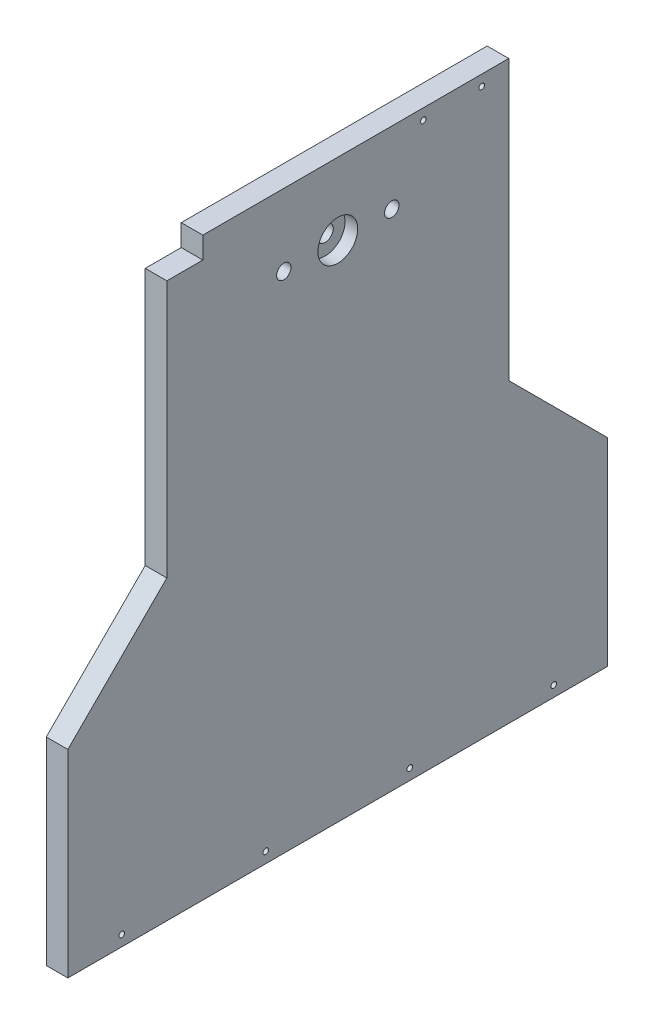
ISO-10303-21;
HEADER;
FILE_DESCRIPTION(('STEP AP214'),'2;1');
FILE_NAME('part.step','',(''),(''),'','','');
FILE_SCHEMA(('AUTOMOTIVE_DESIGN { 1 0 10303 214 1 1 1 1 }'));
ENDSEC;
DATA;
#1=APPLICATION_CONTEXT('core data for automotive mechanical design processes');
#2=APPLICATION_PROTOCOL_DEFINITION('international standard','automotive_design',2000,#1);
#3=PRODUCT_CONTEXT('',#1,'mechanical');
#4=PRODUCT('Part','Part','',(#3));
#5=PRODUCT_RELATED_PRODUCT_CATEGORY('part','',(#4));
#6=PRODUCT_DEFINITION_FORMATION('','',#4);
#7=PRODUCT_DEFINITION_CONTEXT('part definition',#1,'design');
#8=PRODUCT_DEFINITION('design','',#6,#7);
#9=PRODUCT_DEFINITION_SHAPE('','',#8);
#10=(LENGTH_UNIT() NAMED_UNIT(*) SI_UNIT(.MILLI.,.METRE.));
#11=(NAMED_UNIT(*) PLANE_ANGLE_UNIT() SI_UNIT($,.RADIAN.));
#12=(NAMED_UNIT(*) SI_UNIT($,.STERADIAN.) SOLID_ANGLE_UNIT());
#13=UNCERTAINTY_MEASURE_WITH_UNIT(LENGTH_MEASURE(1.E-05),#10,'distance_accuracy_value','');
#14=(GEOMETRIC_REPRESENTATION_CONTEXT(3) GLOBAL_UNCERTAINTY_ASSIGNED_CONTEXT((#13)) GLOBAL_UNIT_ASSIGNED_CONTEXT((#10,
#11,#12)) REPRESENTATION_CONTEXT('',''));
#15=CARTESIAN_POINT('',(0.,0.,0.));
#16=DIRECTION('',(0.,0.,1.));
#17=DIRECTION('',(1.,0.,0.));
#18=AXIS2_PLACEMENT_3D('',#15,#16,#17);
#19=CARTESIAN_POINT('',(12.,280.,0.));
#20=DIRECTION('',(-1.,0.,0.));
#21=DIRECTION('',(0.,0.,1.));
#22=AXIS2_PLACEMENT_3D('',#19,#20,#21);
#23=CYLINDRICAL_SURFACE('',#22,4.5);
#24=CARTESIAN_POINT('',(0.,280.,0.));
#25=DIRECTION('',(-1.,0.,0.));
#26=DIRECTION('',(0.,0.,1.));
#27=AXIS2_PLACEMENT_3D('',#24,#25,#26);
#28=CIRCLE('',#27,4.5);
#29=CARTESIAN_POINT('',(0.,280.,4.5));
#30=VERTEX_POINT('',#29);
#31=EDGE_CURVE('E213',#30,#30,#28,.T.);
#32=ORIENTED_EDGE('',*,*,#31,.T.);
#33=EDGE_LOOP('',(#32));
#34=FACE_BOUND('',#33,.T.);
#35=CARTESIAN_POINT('',(5.,280.,0.));
#36=DIRECTION('',(1.,0.,0.));
#37=DIRECTION('',(0.,0.,-1.));
#38=AXIS2_PLACEMENT_3D('',#35,#36,#37);
#39=CIRCLE('',#38,4.5);
#40=CARTESIAN_POINT('',(5.,280.,-4.5));
#41=VERTEX_POINT('',#40);
#42=EDGE_CURVE('E37',#41,#41,#39,.F.);
#43=ORIENTED_EDGE('',*,*,#42,.F.);
#44=EDGE_LOOP('',(#43));
#45=FACE_BOUND('',#44,.T.);
#46=ADVANCED_FACE('F33',(#34,#45),#23,.F.);
#47=CARTESIAN_POINT('',(12.,110.,-150.));
#48=DIRECTION('',(0.,0.,1.));
#49=DIRECTION('',(1.,0.,0.));
#50=AXIS2_PLACEMENT_3D('',#47,#48,#49);
#51=PLANE('',#50);
#52=DIRECTION('',(0.,1.,0.));
#53=VECTOR('',#52,1.);
#54=CARTESIAN_POINT('',(0.,110.,-150.));
#55=LINE('',#54,#53);
#56=CARTESIAN_POINT('',(0.,0.,-150.));
#57=VERTEX_POINT('',#56);
#58=CARTESIAN_POINT('',(0.,110.,-150.));
#59=VERTEX_POINT('',#58);
#60=EDGE_CURVE('E140',#57,#59,#55,.T.);
#61=ORIENTED_EDGE('',*,*,#60,.T.);
#62=DIRECTION('',(-1.,0.,0.));
#63=VECTOR('',#62,1.);
#64=CARTESIAN_POINT('',(12.,110.,-150.));
#65=LINE('',#64,#63);
#66=CARTESIAN_POINT('',(12.,110.,-150.));
#67=VERTEX_POINT('',#66);
#68=EDGE_CURVE('E11',#67,#59,#65,.T.);
#69=ORIENTED_EDGE('',*,*,#68,.F.);
#70=DIRECTION('',(0.,1.,0.));
#71=VECTOR('',#70,1.);
#72=CARTESIAN_POINT('',(12.,110.,-150.));
#73=LINE('',#72,#71);
#74=CARTESIAN_POINT('',(12.,0.,-150.));
#75=VERTEX_POINT('',#74);
#76=EDGE_CURVE('E157',#75,#67,#73,.T.);
#77=ORIENTED_EDGE('',*,*,#76,.F.);
#78=DIRECTION('',(-1.,0.,0.));
#79=VECTOR('',#78,1.);
#80=CARTESIAN_POINT('',(12.,0.,-150.));
#81=LINE('',#80,#79);
#82=EDGE_CURVE('E136',#75,#57,#81,.T.);
#83=ORIENTED_EDGE('',*,*,#82,.T.);
#84=EDGE_LOOP('',(#61,#69,#77,#83));
#85=FACE_BOUND('',#84,.T.);
#86=ADVANCED_FACE('F35',(#85),#51,.F.);
#87=CARTESIAN_POINT('',(12.,165.,-94.9999999999998));
#88=DIRECTION('',(0.,-0.707106781186548,0.707106781186546));
#89=DIRECTION('',(0.,-0.707106781186546,-0.707106781186549));
#90=AXIS2_PLACEMENT_3D('',#87,#88,#89);
#91=PLANE('',#90);
#92=DIRECTION('',(0.,0.707106781186546,0.707106781186549));
#93=VECTOR('',#92,1.);
#94=CARTESIAN_POINT('',(0.,165.,-94.9999999999998));
#95=LINE('',#94,#93);
#96=CARTESIAN_POINT('',(0.,165.,-94.9999999999998));
#97=VERTEX_POINT('',#96);
#98=EDGE_CURVE('E143',#59,#97,#95,.T.);
#99=ORIENTED_EDGE('',*,*,#98,.T.);
#100=DIRECTION('',(-1.,0.,0.));
#101=VECTOR('',#100,1.);
#102=CARTESIAN_POINT('',(12.,165.,-94.9999999999998));
#103=LINE('',#102,#101);
#104=CARTESIAN_POINT('',(12.,165.,-94.9999999999998));
#105=VERTEX_POINT('',#104);
#106=EDGE_CURVE('E42',#105,#97,#103,.T.);
#107=ORIENTED_EDGE('',*,*,#106,.F.);
#108=DIRECTION('',(0.,0.707106781186546,0.707106781186549));
#109=VECTOR('',#108,1.);
#110=CARTESIAN_POINT('',(12.,165.,-94.9999999999998));
#111=LINE('',#110,#109);
#112=EDGE_CURVE('E96',#67,#105,#111,.T.);
#113=ORIENTED_EDGE('',*,*,#112,.F.);
#114=ORIENTED_EDGE('',*,*,#68,.T.);
#115=EDGE_LOOP('',(#99,#107,#113,#114));
#116=FACE_BOUND('',#115,.T.);
#117=ADVANCED_FACE('F234',(#116),#91,.F.);
#118=CARTESIAN_POINT('',(12.,320.,-94.9999999999998));
#119=DIRECTION('',(0.,0.,1.));
#120=DIRECTION('',(0.,-1.,0.));
#121=AXIS2_PLACEMENT_3D('',#118,#119,#120);
#122=PLANE('',#121);
#123=DIRECTION('',(0.,1.,0.));
#124=VECTOR('',#123,1.);
#125=CARTESIAN_POINT('',(0.,320.,-94.9999999999998));
#126=LINE('',#125,#124);
#127=CARTESIAN_POINT('',(0.,320.,-94.9999999999998));
#128=VERTEX_POINT('',#127);
#129=EDGE_CURVE('E146',#97,#128,#126,.T.);
#130=ORIENTED_EDGE('',*,*,#129,.T.);
#131=DIRECTION('',(-1.,0.,0.));
#132=VECTOR('',#131,1.);
#133=CARTESIAN_POINT('',(12.,320.,-94.9999999999998));
#134=LINE('',#133,#132);
#135=CARTESIAN_POINT('',(12.,320.,-94.9999999999998));
#136=VERTEX_POINT('',#135);
#137=EDGE_CURVE('E161',#136,#128,#134,.T.);
#138=ORIENTED_EDGE('',*,*,#137,.F.);
#139=DIRECTION('',(0.,1.,0.));
#140=VECTOR('',#139,1.);
#141=CARTESIAN_POINT('',(12.,320.,-94.9999999999998));
#142=LINE('',#141,#140);
#143=EDGE_CURVE('E170',#105,#136,#142,.T.);
#144=ORIENTED_EDGE('',*,*,#143,.F.);
#145=ORIENTED_EDGE('',*,*,#106,.T.);
#146=EDGE_LOOP('',(#130,#138,#144,#145));
#147=FACE_BOUND('',#146,.T.);
#148=ADVANCED_FACE('F168',(#147),#122,.F.);
#149=CARTESIAN_POINT('',(12.,320.,-94.9999999999998));
#150=DIRECTION('',(0.,-1.,0.));
#151=DIRECTION('',(0.,0.,-1.));
#152=AXIS2_PLACEMENT_3D('',#149,#150,#151);
#153=PLANE('',#152);
#154=DIRECTION('',(0.,0.,1.));
#155=VECTOR('',#154,1.);
#156=CARTESIAN_POINT('',(0.,320.,-94.9999999999998));
#157=LINE('',#156,#155);
#158=CARTESIAN_POINT('',(0.,320.,74.9999999999998));
#159=VERTEX_POINT('',#158);
#160=EDGE_CURVE('E148',#128,#159,#157,.T.);
#161=ORIENTED_EDGE('',*,*,#160,.T.);
#162=DIRECTION('',(1.,0.,0.));
#163=VECTOR('',#162,1.);
#164=CARTESIAN_POINT('',(0.,320.,74.9999999999998));
#165=LINE('',#164,#163);
#166=CARTESIAN_POINT('',(12.,320.,74.9999999999998));
#167=VERTEX_POINT('',#166);
#168=EDGE_CURVE('E180',#159,#167,#165,.T.);
#169=ORIENTED_EDGE('',*,*,#168,.T.);
#170=DIRECTION('',(0.,0.,1.));
#171=VECTOR('',#170,1.);
#172=CARTESIAN_POINT('',(12.,320.,-94.9999999999998));
#173=LINE('',#172,#171);
#174=EDGE_CURVE('E230',#136,#167,#173,.T.);
#175=ORIENTED_EDGE('',*,*,#174,.F.);
#176=ORIENTED_EDGE('',*,*,#137,.T.);
#177=EDGE_LOOP('',(#161,#169,#175,#176));
#178=FACE_BOUND('',#177,.T.);
#179=ADVANCED_FACE('F178',(#178),#153,.F.);
#180=CARTESIAN_POINT('',(12.,320.,94.9999999999998));
#181=DIRECTION('',(0.,0.,-1.));
#182=DIRECTION('',(0.,1.,0.));
#183=AXIS2_PLACEMENT_3D('',#180,#181,#182);
#184=PLANE('',#183);
#185=DIRECTION('',(0.,-1.,0.));
#186=VECTOR('',#185,1.);
#187=CARTESIAN_POINT('',(12.,320.,94.9999999999998));
#188=LINE('',#187,#186);
#189=CARTESIAN_POINT('',(12.,308.,94.9999999999998));
#190=VERTEX_POINT('',#189);
#191=CARTESIAN_POINT('',(12.,165.,94.9999999999998));
#192=VERTEX_POINT('',#191);
#193=EDGE_CURVE('E119',#190,#192,#188,.T.);
#194=ORIENTED_EDGE('',*,*,#193,.F.);
#195=DIRECTION('',(1.,0.,0.));
#196=VECTOR('',#195,1.);
#197=CARTESIAN_POINT('',(0.,308.,94.9999999999998));
#198=LINE('',#197,#196);
#199=CARTESIAN_POINT('',(0.,308.,94.9999999999998));
#200=VERTEX_POINT('',#199);
#201=EDGE_CURVE('E206',#200,#190,#198,.T.);
#202=ORIENTED_EDGE('',*,*,#201,.F.);
#203=DIRECTION('',(0.,-1.,0.));
#204=VECTOR('',#203,1.);
#205=CARTESIAN_POINT('',(0.,320.,94.9999999999998));
#206=LINE('',#205,#204);
#207=CARTESIAN_POINT('',(0.,165.,94.9999999999998));
#208=VERTEX_POINT('',#207);
#209=EDGE_CURVE('E151',#200,#208,#206,.T.);
#210=ORIENTED_EDGE('',*,*,#209,.T.);
#211=DIRECTION('',(-1.,0.,0.));
#212=VECTOR('',#211,1.);
#213=CARTESIAN_POINT('',(12.,165.,94.9999999999998));
#214=LINE('',#213,#212);
#215=EDGE_CURVE('E131',#192,#208,#214,.T.);
#216=ORIENTED_EDGE('',*,*,#215,.F.);
#217=EDGE_LOOP('',(#194,#202,#210,#216));
#218=FACE_BOUND('',#217,.T.);
#219=ADVANCED_FACE('F273',(#218),#184,.F.);
#220=CARTESIAN_POINT('',(12.,165.,94.9999999999998));
#221=DIRECTION('',(0.,-0.707106781186548,-0.707106781186546));
#222=DIRECTION('',(0.,0.707106781186546,-0.707106781186549));
#223=AXIS2_PLACEMENT_3D('',#220,#221,#222);
#224=PLANE('',#223);
#225=DIRECTION('',(0.,-0.707106781186546,0.707106781186549));
#226=VECTOR('',#225,1.);
#227=CARTESIAN_POINT('',(0.,165.,94.9999999999998));
#228=LINE('',#227,#226);
#229=CARTESIAN_POINT('',(0.,110.,150.));
#230=VERTEX_POINT('',#229);
#231=EDGE_CURVE('E128',#208,#230,#228,.T.);
#232=ORIENTED_EDGE('',*,*,#231,.T.);
#233=DIRECTION('',(-1.,0.,0.));
#234=VECTOR('',#233,1.);
#235=CARTESIAN_POINT('',(12.,110.,150.));
#236=LINE('',#235,#234);
#237=CARTESIAN_POINT('',(12.,110.,150.));
#238=VERTEX_POINT('',#237);
#239=EDGE_CURVE('E125',#238,#230,#236,.T.);
#240=ORIENTED_EDGE('',*,*,#239,.F.);
#241=DIRECTION('',(0.,-0.707106781186546,0.707106781186549));
#242=VECTOR('',#241,1.);
#243=CARTESIAN_POINT('',(12.,165.,94.9999999999998));
#244=LINE('',#243,#242);
#245=EDGE_CURVE('E109',#192,#238,#244,.T.);
#246=ORIENTED_EDGE('',*,*,#245,.F.);
#247=ORIENTED_EDGE('',*,*,#215,.T.);
#248=EDGE_LOOP('',(#232,#240,#246,#247));
#249=FACE_BOUND('',#248,.T.);
#250=ADVANCED_FACE('F126',(#249),#224,.F.);
#251=CARTESIAN_POINT('',(12.,110.,150.));
#252=DIRECTION('',(0.,0.,-1.));
#253=DIRECTION('',(-1.,0.,0.));
#254=AXIS2_PLACEMENT_3D('',#251,#252,#253);
#255=PLANE('',#254);
#256=DIRECTION('',(0.,-1.,0.));
#257=VECTOR('',#256,1.);
#258=CARTESIAN_POINT('',(0.,110.,150.));
#259=LINE('',#258,#257);
#260=CARTESIAN_POINT('',(0.,0.,150.));
#261=VERTEX_POINT('',#260);
#262=EDGE_CURVE('E154',#230,#261,#259,.T.);
#263=ORIENTED_EDGE('',*,*,#262,.T.);
#264=DIRECTION('',(-1.,0.,0.));
#265=VECTOR('',#264,1.);
#266=CARTESIAN_POINT('',(12.,0.,150.));
#267=LINE('',#266,#265);
#268=CARTESIAN_POINT('',(12.,0.,150.));
#269=VERTEX_POINT('',#268);
#270=EDGE_CURVE('E132',#269,#261,#267,.T.);
#271=ORIENTED_EDGE('',*,*,#270,.F.);
#272=DIRECTION('',(0.,-1.,0.));
#273=VECTOR('',#272,1.);
#274=CARTESIAN_POINT('',(12.,110.,150.));
#275=LINE('',#274,#273);
#276=EDGE_CURVE('E115',#238,#269,#275,.T.);
#277=ORIENTED_EDGE('',*,*,#276,.F.);
#278=ORIENTED_EDGE('',*,*,#239,.T.);
#279=EDGE_LOOP('',(#263,#271,#277,#278));
#280=FACE_BOUND('',#279,.T.);
#281=ADVANCED_FACE('F134',(#280),#255,.F.);
#282=CARTESIAN_POINT('',(12.,0.,150.));
#283=DIRECTION('',(0.,1.,0.));
#284=DIRECTION('',(0.,0.,1.));
#285=AXIS2_PLACEMENT_3D('',#282,#283,#284);
#286=PLANE('',#285);
#287=DIRECTION('',(0.,0.,-1.));
#288=VECTOR('',#287,1.);
#289=CARTESIAN_POINT('',(0.,0.,150.));
#290=LINE('',#289,#288);
#291=EDGE_CURVE('E88',#261,#57,#290,.T.);
#292=ORIENTED_EDGE('',*,*,#291,.T.);
#293=ORIENTED_EDGE('',*,*,#82,.F.);
#294=DIRECTION('',(0.,0.,-1.));
#295=VECTOR('',#294,1.);
#296=CARTESIAN_POINT('',(12.,0.,150.));
#297=LINE('',#296,#295);
#298=EDGE_CURVE('E58',#269,#75,#297,.T.);
#299=ORIENTED_EDGE('',*,*,#298,.F.);
#300=ORIENTED_EDGE('',*,*,#270,.T.);
#301=EDGE_LOOP('',(#292,#293,#299,#300));
#302=FACE_BOUND('',#301,.T.);
#303=ADVANCED_FACE('F262',(#302),#286,.F.);
#304=CARTESIAN_POINT('',(12.,0.,0.));
#305=DIRECTION('',(1.,0.,0.));
#306=DIRECTION('',(0.,0.,-1.));
#307=AXIS2_PLACEMENT_3D('',#304,#305,#306);
#308=PLANE('',#307);
#309=CARTESIAN_POINT('',(12.,314.,-47.4999999999999));
#310=DIRECTION('',(1.,0.,0.));
#311=DIRECTION('',(0.,0.,-1.));
#312=AXIS2_PLACEMENT_3D('',#309,#310,#311);
#313=CIRCLE('',#312,1.55000000000002);
#314=CARTESIAN_POINT('',(12.,314.,-49.0499999999999));
#315=VERTEX_POINT('',#314);
#316=EDGE_CURVE('E452',#315,#315,#313,.T.);
#317=ORIENTED_EDGE('',*,*,#316,.F.);
#318=EDGE_LOOP('',(#317));
#319=FACE_BOUND('',#318,.T.);
#320=CARTESIAN_POINT('',(12.,314.,-79.9999999999999));
#321=DIRECTION('',(1.,0.,0.));
#322=DIRECTION('',(0.,0.,-1.));
#323=AXIS2_PLACEMENT_3D('',#320,#321,#322);
#324=CIRCLE('',#323,1.55);
#325=CARTESIAN_POINT('',(12.,314.,-81.5499999999999));
#326=VERTEX_POINT('',#325);
#327=EDGE_CURVE('E454',#326,#326,#324,.T.);
#328=ORIENTED_EDGE('',*,*,#327,.F.);
#329=EDGE_LOOP('',(#328));
#330=FACE_BOUND('',#329,.T.);
#331=CARTESIAN_POINT('',(12.,6.,-120.));
#332=DIRECTION('',(1.,0.,0.));
#333=DIRECTION('',(0.,0.,-1.));
#334=AXIS2_PLACEMENT_3D('',#331,#332,#333);
#335=CIRCLE('',#334,1.54999999999999);
#336=CARTESIAN_POINT('',(12.,6.,-121.55));
#337=VERTEX_POINT('',#336);
#338=EDGE_CURVE('E460',#337,#337,#335,.T.);
#339=ORIENTED_EDGE('',*,*,#338,.F.);
#340=EDGE_LOOP('',(#339));
#341=FACE_BOUND('',#340,.T.);
#342=CARTESIAN_POINT('',(12.,6.,-40.));
#343=DIRECTION('',(1.,0.,0.));
#344=DIRECTION('',(0.,0.,-1.));
#345=AXIS2_PLACEMENT_3D('',#342,#343,#344);
#346=CIRCLE('',#345,1.54999999999999);
#347=CARTESIAN_POINT('',(12.,6.,-41.55));
#348=VERTEX_POINT('',#347);
#349=EDGE_CURVE('E466',#348,#348,#346,.T.);
#350=ORIENTED_EDGE('',*,*,#349,.F.);
#351=EDGE_LOOP('',(#350));
#352=FACE_BOUND('',#351,.T.);
#353=CARTESIAN_POINT('',(12.,6.,40.));
#354=DIRECTION('',(1.,0.,0.));
#355=DIRECTION('',(0.,0.,-1.));
#356=AXIS2_PLACEMENT_3D('',#353,#354,#355);
#357=CIRCLE('',#356,1.54999999999999);
#358=CARTESIAN_POINT('',(12.,6.,38.45));
#359=VERTEX_POINT('',#358);
#360=EDGE_CURVE('E472',#359,#359,#357,.T.);
#361=ORIENTED_EDGE('',*,*,#360,.F.);
#362=EDGE_LOOP('',(#361));
#363=FACE_BOUND('',#362,.T.);
#364=CARTESIAN_POINT('',(12.,6.00000000000001,120.));
#365=DIRECTION('',(1.,0.,0.));
#366=DIRECTION('',(0.,0.,-1.));
#367=AXIS2_PLACEMENT_3D('',#364,#365,#366);
#368=CIRCLE('',#367,1.54999999999999);
#369=CARTESIAN_POINT('',(12.,6.00000000000001,118.45));
#370=VERTEX_POINT('',#369);
#371=EDGE_CURVE('E478',#370,#370,#368,.T.);
#372=ORIENTED_EDGE('',*,*,#371,.F.);
#373=EDGE_LOOP('',(#372));
#374=FACE_BOUND('',#373,.T.);
#375=DIRECTION('',(0.,1.,0.));
#376=VECTOR('',#375,1.);
#377=CARTESIAN_POINT('',(12.,320.,74.9999999999998));
#378=LINE('',#377,#376);
#379=CARTESIAN_POINT('',(12.,308.,74.9999999999998));
#380=VERTEX_POINT('',#379);
#381=EDGE_CURVE('E193',#380,#167,#378,.T.);
#382=ORIENTED_EDGE('',*,*,#381,.F.);
#383=DIRECTION('',(0.,0.,-1.));
#384=VECTOR('',#383,1.);
#385=CARTESIAN_POINT('',(12.,308.,94.9999999999998));
#386=LINE('',#385,#384);
#387=EDGE_CURVE('E196',#190,#380,#386,.T.);
#388=ORIENTED_EDGE('',*,*,#387,.F.);
#389=ORIENTED_EDGE('',*,*,#193,.T.);
#390=ORIENTED_EDGE('',*,*,#245,.T.);
#391=ORIENTED_EDGE('',*,*,#276,.T.);
#392=ORIENTED_EDGE('',*,*,#298,.T.);
#393=ORIENTED_EDGE('',*,*,#76,.T.);
#394=ORIENTED_EDGE('',*,*,#112,.T.);
#395=ORIENTED_EDGE('',*,*,#143,.T.);
#396=ORIENTED_EDGE('',*,*,#174,.T.);
#397=EDGE_LOOP('',(#382,#388,#389,#390,#391,#392,#393,#394,#395,#396));
#398=FACE_BOUND('',#397,.T.);
#399=CARTESIAN_POINT('',(12.,280.,0.));
#400=DIRECTION('',(1.,0.,0.));
#401=DIRECTION('',(0.,0.,-1.));
#402=AXIS2_PLACEMENT_3D('',#399,#400,#401);
#403=CIRCLE('',#402,11.05);
#404=CARTESIAN_POINT('',(12.,280.,-11.05));
#405=VERTEX_POINT('',#404);
#406=EDGE_CURVE('E204',#405,#405,#403,.T.);
#407=ORIENTED_EDGE('',*,*,#406,.F.);
#408=EDGE_LOOP('',(#407));
#409=FACE_BOUND('',#408,.T.);
#410=CARTESIAN_POINT('',(12.,280.,-29.9999999999998));
#411=DIRECTION('',(-1.,0.,0.));
#412=DIRECTION('',(0.,0.,1.));
#413=AXIS2_PLACEMENT_3D('',#410,#411,#412);
#414=CIRCLE('',#413,4.);
#415=CARTESIAN_POINT('',(12.,280.,-25.9999999999998));
#416=VERTEX_POINT('',#415);
#417=EDGE_CURVE('E217',#416,#416,#414,.T.);
#418=ORIENTED_EDGE('',*,*,#417,.T.);
#419=EDGE_LOOP('',(#418));
#420=FACE_BOUND('',#419,.T.);
#421=CARTESIAN_POINT('',(12.,280.,29.9999999999998));
#422=DIRECTION('',(-1.,0.,0.));
#423=DIRECTION('',(0.,0.,1.));
#424=AXIS2_PLACEMENT_3D('',#421,#422,#423);
#425=CIRCLE('',#424,4.00000000000001);
#426=CARTESIAN_POINT('',(12.,280.,33.9999999999998));
#427=VERTEX_POINT('',#426);
#428=EDGE_CURVE('E144',#427,#427,#425,.T.);
#429=ORIENTED_EDGE('',*,*,#428,.T.);
#430=EDGE_LOOP('',(#429));
#431=FACE_BOUND('',#430,.T.);
#432=ADVANCED_FACE('F112',(#319,#330,#341,#352,#363,#374,#398,#409,#420,#431),#308,.T.);
#433=CARTESIAN_POINT('',(0.,0.,0.));
#434=DIRECTION('',(1.,0.,0.));
#435=DIRECTION('',(0.,0.,-1.));
#436=AXIS2_PLACEMENT_3D('',#433,#434,#435);
#437=PLANE('',#436);
#438=CARTESIAN_POINT('',(0.,314.,-47.4999999999999));
#439=DIRECTION('',(1.,0.,0.));
#440=DIRECTION('',(0.,0.,-1.));
#441=AXIS2_PLACEMENT_3D('',#438,#439,#440);
#442=CIRCLE('',#441,1.55000000000002);
#443=CARTESIAN_POINT('',(0.,314.,-49.0499999999999));
#444=VERTEX_POINT('',#443);
#445=EDGE_CURVE('E449',#444,#444,#442,.T.);
#446=ORIENTED_EDGE('',*,*,#445,.T.);
#447=EDGE_LOOP('',(#446));
#448=FACE_BOUND('',#447,.T.);
#449=CARTESIAN_POINT('',(0.,314.,-79.9999999999999));
#450=DIRECTION('',(1.,0.,0.));
#451=DIRECTION('',(0.,0.,-1.));
#452=AXIS2_PLACEMENT_3D('',#449,#450,#451);
#453=CIRCLE('',#452,1.55);
#454=CARTESIAN_POINT('',(0.,314.,-81.5499999999999));
#455=VERTEX_POINT('',#454);
#456=EDGE_CURVE('E457',#455,#455,#453,.T.);
#457=ORIENTED_EDGE('',*,*,#456,.T.);
#458=EDGE_LOOP('',(#457));
#459=FACE_BOUND('',#458,.T.);
#460=CARTESIAN_POINT('',(0.,6.,-120.));
#461=DIRECTION('',(1.,0.,0.));
#462=DIRECTION('',(0.,0.,-1.));
#463=AXIS2_PLACEMENT_3D('',#460,#461,#462);
#464=CIRCLE('',#463,1.54999999999999);
#465=CARTESIAN_POINT('',(0.,6.,-121.55));
#466=VERTEX_POINT('',#465);
#467=EDGE_CURVE('E463',#466,#466,#464,.T.);
#468=ORIENTED_EDGE('',*,*,#467,.T.);
#469=EDGE_LOOP('',(#468));
#470=FACE_BOUND('',#469,.T.);
#471=CARTESIAN_POINT('',(0.,6.,-40.));
#472=DIRECTION('',(1.,0.,0.));
#473=DIRECTION('',(0.,0.,-1.));
#474=AXIS2_PLACEMENT_3D('',#471,#472,#473);
#475=CIRCLE('',#474,1.54999999999999);
#476=CARTESIAN_POINT('',(0.,6.,-41.55));
#477=VERTEX_POINT('',#476);
#478=EDGE_CURVE('E469',#477,#477,#475,.T.);
#479=ORIENTED_EDGE('',*,*,#478,.T.);
#480=EDGE_LOOP('',(#479));
#481=FACE_BOUND('',#480,.T.);
#482=CARTESIAN_POINT('',(0.,6.,40.));
#483=DIRECTION('',(1.,0.,0.));
#484=DIRECTION('',(0.,0.,-1.));
#485=AXIS2_PLACEMENT_3D('',#482,#483,#484);
#486=CIRCLE('',#485,1.54999999999999);
#487=CARTESIAN_POINT('',(0.,6.,38.45));
#488=VERTEX_POINT('',#487);
#489=EDGE_CURVE('E475',#488,#488,#486,.T.);
#490=ORIENTED_EDGE('',*,*,#489,.T.);
#491=EDGE_LOOP('',(#490));
#492=FACE_BOUND('',#491,.T.);
#493=CARTESIAN_POINT('',(0.,6.00000000000001,120.));
#494=DIRECTION('',(1.,0.,0.));
#495=DIRECTION('',(0.,0.,-1.));
#496=AXIS2_PLACEMENT_3D('',#493,#494,#495);
#497=CIRCLE('',#496,1.54999999999999);
#498=CARTESIAN_POINT('',(0.,6.00000000000001,118.45));
#499=VERTEX_POINT('',#498);
#500=EDGE_CURVE('E199',#499,#499,#497,.T.);
#501=ORIENTED_EDGE('',*,*,#500,.T.);
#502=EDGE_LOOP('',(#501));
#503=FACE_BOUND('',#502,.T.);
#504=ORIENTED_EDGE('',*,*,#31,.F.);
#505=EDGE_LOOP('',(#504));
#506=FACE_BOUND('',#505,.T.);
#507=CARTESIAN_POINT('',(0.,280.,-29.9999999999998));
#508=DIRECTION('',(-1.,0.,0.));
#509=DIRECTION('',(0.,0.,1.));
#510=AXIS2_PLACEMENT_3D('',#507,#508,#509);
#511=CIRCLE('',#510,4.);
#512=CARTESIAN_POINT('',(0.,280.,-25.9999999999998));
#513=VERTEX_POINT('',#512);
#514=EDGE_CURVE('E216',#513,#513,#511,.T.);
#515=ORIENTED_EDGE('',*,*,#514,.F.);
#516=EDGE_LOOP('',(#515));
#517=FACE_BOUND('',#516,.T.);
#518=CARTESIAN_POINT('',(0.,280.,29.9999999999998));
#519=DIRECTION('',(-1.,0.,0.));
#520=DIRECTION('',(0.,0.,1.));
#521=AXIS2_PLACEMENT_3D('',#518,#519,#520);
#522=CIRCLE('',#521,4.00000000000001);
#523=CARTESIAN_POINT('',(0.,280.,33.9999999999998));
#524=VERTEX_POINT('',#523);
#525=EDGE_CURVE('E220',#524,#524,#522,.T.);
#526=ORIENTED_EDGE('',*,*,#525,.F.);
#527=EDGE_LOOP('',(#526));
#528=FACE_BOUND('',#527,.T.);
#529=DIRECTION('',(0.,0.,-1.));
#530=VECTOR('',#529,1.);
#531=CARTESIAN_POINT('',(0.,308.,94.9999999999998));
#532=LINE('',#531,#530);
#533=CARTESIAN_POINT('',(0.,308.,74.9999999999998));
#534=VERTEX_POINT('',#533);
#535=EDGE_CURVE('E195',#200,#534,#532,.T.);
#536=ORIENTED_EDGE('',*,*,#535,.T.);
#537=DIRECTION('',(0.,1.,0.));
#538=VECTOR('',#537,1.);
#539=CARTESIAN_POINT('',(0.,320.,74.9999999999998));
#540=LINE('',#539,#538);
#541=EDGE_CURVE('E49',#534,#159,#540,.T.);
#542=ORIENTED_EDGE('',*,*,#541,.T.);
#543=ORIENTED_EDGE('',*,*,#160,.F.);
#544=ORIENTED_EDGE('',*,*,#129,.F.);
#545=ORIENTED_EDGE('',*,*,#98,.F.);
#546=ORIENTED_EDGE('',*,*,#60,.F.);
#547=ORIENTED_EDGE('',*,*,#291,.F.);
#548=ORIENTED_EDGE('',*,*,#262,.F.);
#549=ORIENTED_EDGE('',*,*,#231,.F.);
#550=ORIENTED_EDGE('',*,*,#209,.F.);
#551=EDGE_LOOP('',(#536,#542,#543,#544,#545,#546,#547,#548,#549,#550));
#552=FACE_BOUND('',#551,.T.);
#553=ADVANCED_FACE('F174',(#448,#459,#470,#481,#492,#503,#506,#517,#528,#552),#437,.F.);
#554=CARTESIAN_POINT('',(12.,280.,29.9999999999998));
#555=DIRECTION('',(-1.,0.,0.));
#556=DIRECTION('',(0.,0.,1.));
#557=AXIS2_PLACEMENT_3D('',#554,#555,#556);
#558=CYLINDRICAL_SURFACE('',#557,4.00000000000001);
#559=ORIENTED_EDGE('',*,*,#428,.F.);
#560=EDGE_LOOP('',(#559));
#561=FACE_BOUND('',#560,.T.);
#562=ORIENTED_EDGE('',*,*,#525,.T.);
#563=EDGE_LOOP('',(#562));
#564=FACE_BOUND('',#563,.T.);
#565=ADVANCED_FACE('F255',(#561,#564),#558,.F.);
#566=CARTESIAN_POINT('',(12.,280.,-29.9999999999998));
#567=DIRECTION('',(-1.,0.,0.));
#568=DIRECTION('',(0.,0.,1.));
#569=AXIS2_PLACEMENT_3D('',#566,#567,#568);
#570=CYLINDRICAL_SURFACE('',#569,4.);
#571=ORIENTED_EDGE('',*,*,#417,.F.);
#572=EDGE_LOOP('',(#571));
#573=FACE_BOUND('',#572,.T.);
#574=ORIENTED_EDGE('',*,*,#514,.T.);
#575=EDGE_LOOP('',(#574));
#576=FACE_BOUND('',#575,.T.);
#577=ADVANCED_FACE('F251',(#573,#576),#570,.F.);
#578=CARTESIAN_POINT('',(5.,280.,0.));
#579=DIRECTION('',(1.,0.,0.));
#580=DIRECTION('',(0.,0.,-1.));
#581=AXIS2_PLACEMENT_3D('',#578,#579,#580);
#582=PLANE('',#581);
#583=CARTESIAN_POINT('',(5.,280.,0.));
#584=DIRECTION('',(1.,0.,0.));
#585=DIRECTION('',(0.,0.,-1.));
#586=AXIS2_PLACEMENT_3D('',#583,#584,#585);
#587=CIRCLE('',#586,11.05);
#588=CARTESIAN_POINT('',(5.,280.,-11.05));
#589=VERTEX_POINT('',#588);
#590=EDGE_CURVE('E208',#589,#589,#587,.T.);
#591=ORIENTED_EDGE('',*,*,#590,.T.);
#592=EDGE_LOOP('',(#591));
#593=FACE_BOUND('',#592,.T.);
#594=ORIENTED_EDGE('',*,*,#42,.T.);
#595=EDGE_LOOP('',(#594));
#596=FACE_BOUND('',#595,.T.);
#597=ADVANCED_FACE('F254',(#593,#596),#582,.T.);
#598=CARTESIAN_POINT('',(5.,280.,0.));
#599=DIRECTION('',(1.,0.,0.));
#600=DIRECTION('',(0.,0.,-1.));
#601=AXIS2_PLACEMENT_3D('',#598,#599,#600);
#602=CYLINDRICAL_SURFACE('',#601,11.05);
#603=ORIENTED_EDGE('',*,*,#590,.F.);
#604=EDGE_LOOP('',(#603));
#605=FACE_BOUND('',#604,.T.);
#606=ORIENTED_EDGE('',*,*,#406,.T.);
#607=EDGE_LOOP('',(#606));
#608=FACE_BOUND('',#607,.T.);
#609=ADVANCED_FACE('F249',(#605,#608),#602,.F.);
#610=CARTESIAN_POINT('',(0.,320.,74.9999999999998));
#611=DIRECTION('',(0.,0.,-1.));
#612=DIRECTION('',(-1.,0.,0.));
#613=AXIS2_PLACEMENT_3D('',#610,#611,#612);
#614=PLANE('',#613);
#615=ORIENTED_EDGE('',*,*,#381,.T.);
#616=ORIENTED_EDGE('',*,*,#168,.F.);
#617=ORIENTED_EDGE('',*,*,#541,.F.);
#618=DIRECTION('',(1.,0.,0.));
#619=VECTOR('',#618,1.);
#620=CARTESIAN_POINT('',(0.,308.,74.9999999999998));
#621=LINE('',#620,#619);
#622=EDGE_CURVE('E191',#534,#380,#621,.T.);
#623=ORIENTED_EDGE('',*,*,#622,.T.);
#624=EDGE_LOOP('',(#615,#616,#617,#623));
#625=FACE_BOUND('',#624,.T.);
#626=ADVANCED_FACE('F194',(#625),#614,.F.);
#627=CARTESIAN_POINT('',(0.,308.,94.9999999999998));
#628=DIRECTION('',(0.,-1.,0.));
#629=DIRECTION('',(0.,0.,-1.));
#630=AXIS2_PLACEMENT_3D('',#627,#628,#629);
#631=PLANE('',#630);
#632=ORIENTED_EDGE('',*,*,#387,.T.);
#633=ORIENTED_EDGE('',*,*,#622,.F.);
#634=ORIENTED_EDGE('',*,*,#535,.F.);
#635=ORIENTED_EDGE('',*,*,#201,.T.);
#636=EDGE_LOOP('',(#632,#633,#634,#635));
#637=FACE_BOUND('',#636,.T.);
#638=ADVANCED_FACE('F334',(#637),#631,.F.);
#639=CARTESIAN_POINT('',(0.,6.00000000000001,120.));
#640=DIRECTION('',(1.,0.,0.));
#641=DIRECTION('',(0.,0.,-1.));
#642=AXIS2_PLACEMENT_3D('',#639,#640,#641);
#643=CYLINDRICAL_SURFACE('',#642,1.54999999999999);
#644=ORIENTED_EDGE('',*,*,#500,.F.);
#645=EDGE_LOOP('',(#644));
#646=FACE_BOUND('',#645,.T.);
#647=ORIENTED_EDGE('',*,*,#371,.T.);
#648=EDGE_LOOP('',(#647));
#649=FACE_BOUND('',#648,.T.);
#650=ADVANCED_FACE('F340',(#646,#649),#643,.F.);
#651=CARTESIAN_POINT('',(0.,6.,40.));
#652=DIRECTION('',(1.,0.,0.));
#653=DIRECTION('',(0.,0.,-1.));
#654=AXIS2_PLACEMENT_3D('',#651,#652,#653);
#655=CYLINDRICAL_SURFACE('',#654,1.54999999999999);
#656=ORIENTED_EDGE('',*,*,#489,.F.);
#657=EDGE_LOOP('',(#656));
#658=FACE_BOUND('',#657,.T.);
#659=ORIENTED_EDGE('',*,*,#360,.T.);
#660=EDGE_LOOP('',(#659));
#661=FACE_BOUND('',#660,.T.);
#662=ADVANCED_FACE('F347',(#658,#661),#655,.F.);
#663=CARTESIAN_POINT('',(0.,6.,-40.));
#664=DIRECTION('',(1.,0.,0.));
#665=DIRECTION('',(0.,0.,-1.));
#666=AXIS2_PLACEMENT_3D('',#663,#664,#665);
#667=CYLINDRICAL_SURFACE('',#666,1.54999999999999);
#668=ORIENTED_EDGE('',*,*,#478,.F.);
#669=EDGE_LOOP('',(#668));
#670=FACE_BOUND('',#669,.T.);
#671=ORIENTED_EDGE('',*,*,#349,.T.);
#672=EDGE_LOOP('',(#671));
#673=FACE_BOUND('',#672,.T.);
#674=ADVANCED_FACE('F355',(#670,#673),#667,.F.);
#675=CARTESIAN_POINT('',(0.,6.,-120.));
#676=DIRECTION('',(1.,0.,0.));
#677=DIRECTION('',(0.,0.,-1.));
#678=AXIS2_PLACEMENT_3D('',#675,#676,#677);
#679=CYLINDRICAL_SURFACE('',#678,1.54999999999999);
#680=ORIENTED_EDGE('',*,*,#467,.F.);
#681=EDGE_LOOP('',(#680));
#682=FACE_BOUND('',#681,.T.);
#683=ORIENTED_EDGE('',*,*,#338,.T.);
#684=EDGE_LOOP('',(#683));
#685=FACE_BOUND('',#684,.T.);
#686=ADVANCED_FACE('F363',(#682,#685),#679,.F.);
#687=CARTESIAN_POINT('',(0.,314.,-79.9999999999999));
#688=DIRECTION('',(1.,0.,0.));
#689=DIRECTION('',(0.,0.,-1.));
#690=AXIS2_PLACEMENT_3D('',#687,#688,#689);
#691=CYLINDRICAL_SURFACE('',#690,1.55);
#692=ORIENTED_EDGE('',*,*,#456,.F.);
#693=EDGE_LOOP('',(#692));
#694=FACE_BOUND('',#693,.T.);
#695=ORIENTED_EDGE('',*,*,#327,.T.);
#696=EDGE_LOOP('',(#695));
#697=FACE_BOUND('',#696,.T.);
#698=ADVANCED_FACE('F371',(#694,#697),#691,.F.);
#699=CARTESIAN_POINT('',(0.,314.,-47.4999999999999));
#700=DIRECTION('',(1.,0.,0.));
#701=DIRECTION('',(0.,0.,-1.));
#702=AXIS2_PLACEMENT_3D('',#699,#700,#701);
#703=CYLINDRICAL_SURFACE('',#702,1.55000000000002);
#704=ORIENTED_EDGE('',*,*,#445,.F.);
#705=EDGE_LOOP('',(#704));
#706=FACE_BOUND('',#705,.T.);
#707=ORIENTED_EDGE('',*,*,#316,.T.);
#708=EDGE_LOOP('',(#707));
#709=FACE_BOUND('',#708,.T.);
#710=ADVANCED_FACE('F379',(#706,#709),#703,.F.);
#711=CLOSED_SHELL('',(#46,#86,#117,#148,#179,#219,#250,#281,#303,#432,#553,#565,#577,#597,#609,
#626,#638,#650,#662,#674,#686,#698,#710));
#712=MANIFOLD_SOLID_BREP('B2',#711);
#713=ADVANCED_BREP_SHAPE_REPRESENTATION('',(#18,#712),#14);
#714=SHAPE_DEFINITION_REPRESENTATION(#9,#713);
ENDSEC;
END-ISO-10303-21;
